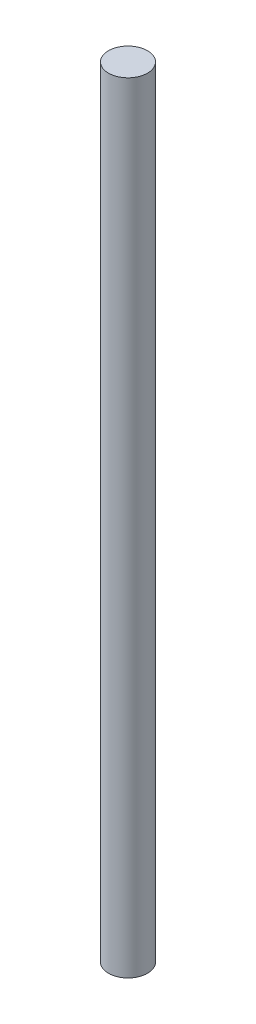
ISO-10303-21;
HEADER;
FILE_DESCRIPTION(('STEP AP214'),'2;1');
FILE_NAME('part.step','',(''),(''),'','','');
FILE_SCHEMA(('AUTOMOTIVE_DESIGN { 1 0 10303 214 1 1 1 1 }'));
ENDSEC;
DATA;
#1=APPLICATION_CONTEXT('core data for automotive mechanical design processes');
#2=APPLICATION_PROTOCOL_DEFINITION('international standard','automotive_design',2000,#1);
#3=PRODUCT_CONTEXT('',#1,'mechanical');
#4=PRODUCT('Part','Part','',(#3));
#5=PRODUCT_RELATED_PRODUCT_CATEGORY('part','',(#4));
#6=PRODUCT_DEFINITION_FORMATION('','',#4);
#7=PRODUCT_DEFINITION_CONTEXT('part definition',#1,'design');
#8=PRODUCT_DEFINITION('design','',#6,#7);
#9=PRODUCT_DEFINITION_SHAPE('','',#8);
#10=(LENGTH_UNIT() NAMED_UNIT(*) SI_UNIT(.MILLI.,.METRE.));
#11=(NAMED_UNIT(*) PLANE_ANGLE_UNIT() SI_UNIT($,.RADIAN.));
#12=(NAMED_UNIT(*) SI_UNIT($,.STERADIAN.) SOLID_ANGLE_UNIT());
#13=UNCERTAINTY_MEASURE_WITH_UNIT(LENGTH_MEASURE(1.E-05),#10,'distance_accuracy_value','');
#14=(GEOMETRIC_REPRESENTATION_CONTEXT(3) GLOBAL_UNCERTAINTY_ASSIGNED_CONTEXT((#13)) GLOBAL_UNIT_ASSIGNED_CONTEXT((#10,
#11,#12)) REPRESENTATION_CONTEXT('',''));
#15=CARTESIAN_POINT('',(0.,0.,0.));
#16=DIRECTION('',(0.,0.,1.));
#17=DIRECTION('',(1.,0.,0.));
#18=AXIS2_PLACEMENT_3D('',#15,#16,#17);
#19=CARTESIAN_POINT('',(0.,5.,0.));
#20=DIRECTION('',(0.,-1.,0.));
#21=DIRECTION('',(0.,0.,-1.));
#22=AXIS2_PLACEMENT_3D('',#19,#20,#21);
#23=CYLINDRICAL_SURFACE('',#22,0.125);
#24=CARTESIAN_POINT('',(0.,5.,0.));
#25=DIRECTION('',(0.,1.,0.));
#26=DIRECTION('',(0.,0.,1.));
#27=AXIS2_PLACEMENT_3D('',#24,#25,#26);
#28=CIRCLE('',#27,0.125);
#29=CARTESIAN_POINT('',(0.,5.,0.125));
#30=VERTEX_POINT('',#29);
#31=EDGE_CURVE('E10',#30,#30,#28,.T.);
#32=ORIENTED_EDGE('',*,*,#31,.F.);
#33=EDGE_LOOP('',(#32));
#34=FACE_BOUND('',#33,.T.);
#35=CARTESIAN_POINT('',(0.,0.,0.));
#36=DIRECTION('',(0.,1.,0.));
#37=DIRECTION('',(0.,0.,1.));
#38=AXIS2_PLACEMENT_3D('',#35,#36,#37);
#39=CIRCLE('',#38,0.125);
#40=CARTESIAN_POINT('',(0.,0.,0.125));
#41=VERTEX_POINT('',#40);
#42=EDGE_CURVE('E34',#41,#41,#39,.T.);
#43=ORIENTED_EDGE('',*,*,#42,.T.);
#44=EDGE_LOOP('',(#43));
#45=FACE_BOUND('',#44,.T.);
#46=ADVANCED_FACE('F31',(#34,#45),#23,.T.);
#47=CARTESIAN_POINT('',(0.,5.,0.));
#48=DIRECTION('',(0.,1.,0.));
#49=DIRECTION('',(0.,0.,1.));
#50=AXIS2_PLACEMENT_3D('',#47,#48,#49);
#51=PLANE('',#50);
#52=ORIENTED_EDGE('',*,*,#31,.T.);
#53=EDGE_LOOP('',(#52));
#54=FACE_BOUND('',#53,.T.);
#55=ADVANCED_FACE('F46',(#54),#51,.T.);
#56=CARTESIAN_POINT('',(0.,0.,0.));
#57=DIRECTION('',(0.,1.,0.));
#58=DIRECTION('',(0.,0.,1.));
#59=AXIS2_PLACEMENT_3D('',#56,#57,#58);
#60=PLANE('',#59);
#61=ORIENTED_EDGE('',*,*,#42,.F.);
#62=EDGE_LOOP('',(#61));
#63=FACE_BOUND('',#62,.T.);
#64=ADVANCED_FACE('F44',(#63),#60,.F.);
#65=CLOSED_SHELL('',(#46,#55,#64));
#66=MANIFOLD_SOLID_BREP('B2',#65);
#67=ADVANCED_BREP_SHAPE_REPRESENTATION('',(#18,#66),#14);
#68=SHAPE_DEFINITION_REPRESENTATION(#9,#67);
ENDSEC;
END-ISO-10303-21;
